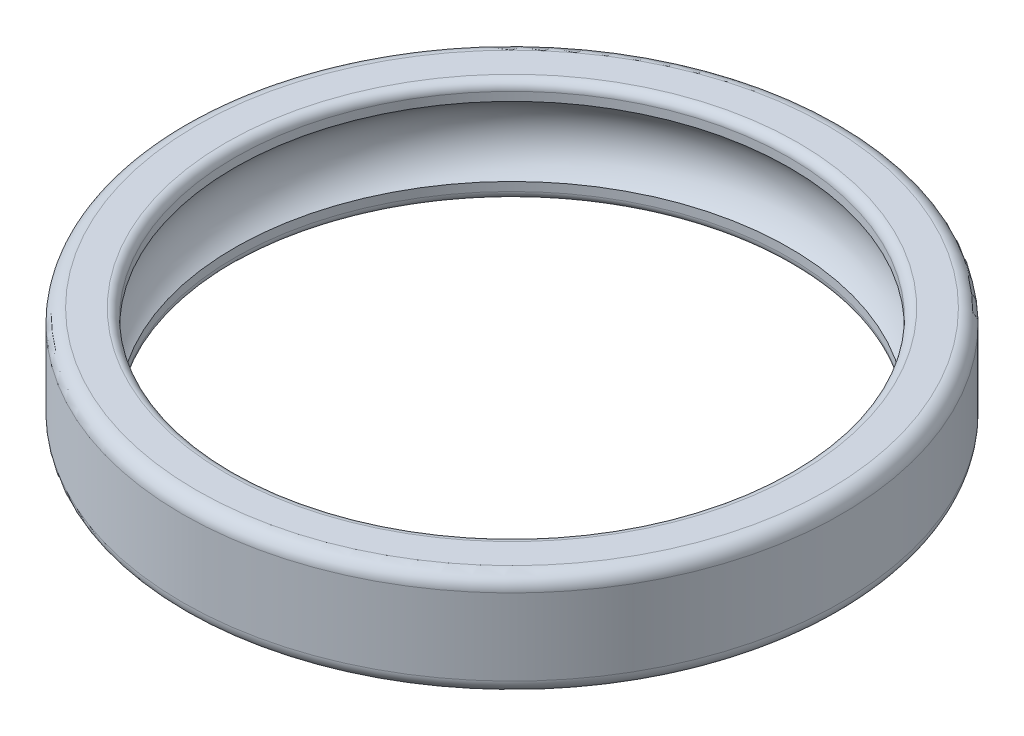
ISO-10303-21;
HEADER;
FILE_DESCRIPTION(('STEP AP214'),'2;1');
FILE_NAME('part.step','',(''),(''),'','','');
FILE_SCHEMA(('AUTOMOTIVE_DESIGN { 1 0 10303 214 1 1 1 1 }'));
ENDSEC;
DATA;
#1=APPLICATION_CONTEXT('core data for automotive mechanical design processes');
#2=APPLICATION_PROTOCOL_DEFINITION('international standard','automotive_design',2000,#1);
#3=PRODUCT_CONTEXT('',#1,'mechanical');
#4=PRODUCT('Part','Part','',(#3));
#5=PRODUCT_RELATED_PRODUCT_CATEGORY('part','',(#4));
#6=PRODUCT_DEFINITION_FORMATION('','',#4);
#7=PRODUCT_DEFINITION_CONTEXT('part definition',#1,'design');
#8=PRODUCT_DEFINITION('design','',#6,#7);
#9=PRODUCT_DEFINITION_SHAPE('','',#8);
#10=(LENGTH_UNIT() NAMED_UNIT(*) SI_UNIT(.MILLI.,.METRE.));
#11=(NAMED_UNIT(*) PLANE_ANGLE_UNIT() SI_UNIT($,.RADIAN.));
#12=(NAMED_UNIT(*) SI_UNIT($,.STERADIAN.) SOLID_ANGLE_UNIT());
#13=UNCERTAINTY_MEASURE_WITH_UNIT(LENGTH_MEASURE(1.E-05),#10,'distance_accuracy_value','');
#14=(GEOMETRIC_REPRESENTATION_CONTEXT(3) GLOBAL_UNCERTAINTY_ASSIGNED_CONTEXT((#13)) GLOBAL_UNIT_ASSIGNED_CONTEXT((#10,
#11,#12)) REPRESENTATION_CONTEXT('',''));
#15=CARTESIAN_POINT('',(0.,0.,0.));
#16=DIRECTION('',(0.,0.,1.));
#17=DIRECTION('',(1.,0.,0.));
#18=AXIS2_PLACEMENT_3D('',#15,#16,#17);
#19=CARTESIAN_POINT('',(0.,6.,0.));
#20=DIRECTION('',(0.,-1.,0.));
#21=DIRECTION('',(0.,0.,-1.));
#22=AXIS2_PLACEMENT_3D('',#19,#20,#21);
#23=CYLINDRICAL_SURFACE('',#22,16.);
#24=CARTESIAN_POINT('',(0.,5.5,0.));
#25=DIRECTION('',(0.,1.,0.));
#26=DIRECTION('',(0.,0.,1.));
#27=AXIS2_PLACEMENT_3D('',#24,#25,#26);
#28=CIRCLE('',#27,16.);
#29=CARTESIAN_POINT('',(0.,5.5,16.));
#30=VERTEX_POINT('',#29);
#31=EDGE_CURVE('E59',#30,#30,#28,.T.);
#32=ORIENTED_EDGE('',*,*,#31,.T.);
#33=EDGE_LOOP('',(#32));
#34=FACE_BOUND('',#33,.T.);
#35=CARTESIAN_POINT('',(0.,5.,0.));
#36=DIRECTION('',(0.,-1.,0.));
#37=DIRECTION('',(0.,0.,-1.));
#38=AXIS2_PLACEMENT_3D('',#35,#36,#37);
#39=CIRCLE('',#38,16.);
#40=CARTESIAN_POINT('',(0.,5.,-16.));
#41=VERTEX_POINT('',#40);
#42=EDGE_CURVE('E84',#41,#41,#39,.T.);
#43=ORIENTED_EDGE('',*,*,#42,.T.);
#44=EDGE_LOOP('',(#43));
#45=FACE_BOUND('',#44,.T.);
#46=ADVANCED_FACE('F52',(#34,#45),#23,.F.);
#47=CARTESIAN_POINT('',(0.,0.5,0.));
#48=DIRECTION('',(0.,1.,0.));
#49=DIRECTION('',(0.,0.,1.));
#50=AXIS2_PLACEMENT_3D('',#47,#48,#49);
#51=CIRCLE('',#50,16.);
#52=CARTESIAN_POINT('',(0.,0.5,16.));
#53=VERTEX_POINT('',#52);
#54=EDGE_CURVE('E63',#53,#53,#51,.F.);
#55=ORIENTED_EDGE('',*,*,#54,.T.);
#56=EDGE_LOOP('',(#55));
#57=FACE_BOUND('',#56,.T.);
#58=CARTESIAN_POINT('',(0.,0.999999999999999,0.));
#59=DIRECTION('',(0.,1.,0.));
#60=DIRECTION('',(0.,0.,1.));
#61=AXIS2_PLACEMENT_3D('',#58,#59,#60);
#62=CIRCLE('',#61,16.);
#63=CARTESIAN_POINT('',(0.,0.999999999999999,16.));
#64=VERTEX_POINT('',#63);
#65=EDGE_CURVE('E87',#64,#64,#62,.T.);
#66=ORIENTED_EDGE('',*,*,#65,.T.);
#67=EDGE_LOOP('',(#66));
#68=FACE_BOUND('',#67,.T.);
#69=ADVANCED_FACE('F91',(#57,#68),#23,.F.);
#70=CARTESIAN_POINT('',(0.,6.,0.));
#71=DIRECTION('',(0.,1.,0.));
#72=DIRECTION('',(0.,0.,1.));
#73=AXIS2_PLACEMENT_3D('',#70,#71,#72);
#74=PLANE('',#73);
#75=CARTESIAN_POINT('',(0.,6.,0.));
#76=DIRECTION('',(0.,1.,0.));
#77=DIRECTION('',(0.,0.,1.));
#78=AXIS2_PLACEMENT_3D('',#75,#76,#77);
#79=CIRCLE('',#78,16.5);
#80=CARTESIAN_POINT('',(0.,6.,16.5));
#81=VERTEX_POINT('',#80);
#82=EDGE_CURVE('E38',#81,#81,#79,.F.);
#83=ORIENTED_EDGE('',*,*,#82,.T.);
#84=EDGE_LOOP('',(#83));
#85=FACE_BOUND('',#84,.T.);
#86=CARTESIAN_POINT('',(0.,6.,0.));
#87=DIRECTION('',(0.,1.,0.));
#88=DIRECTION('',(0.,0.,1.));
#89=AXIS2_PLACEMENT_3D('',#86,#87,#88);
#90=CIRCLE('',#89,18.2);
#91=CARTESIAN_POINT('',(0.,6.,18.2));
#92=VERTEX_POINT('',#91);
#93=EDGE_CURVE('E81',#92,#92,#90,.T.);
#94=ORIENTED_EDGE('',*,*,#93,.T.);
#95=EDGE_LOOP('',(#94));
#96=FACE_BOUND('',#95,.T.);
#97=ADVANCED_FACE('F115',(#85,#96),#74,.T.);
#98=CARTESIAN_POINT('',(0.,0.,0.));
#99=DIRECTION('',(0.,1.,0.));
#100=DIRECTION('',(0.,0.,1.));
#101=AXIS2_PLACEMENT_3D('',#98,#99,#100);
#102=PLANE('',#101);
#103=CARTESIAN_POINT('',(0.,0.,0.));
#104=DIRECTION('',(0.,1.,0.));
#105=DIRECTION('',(0.,0.,1.));
#106=AXIS2_PLACEMENT_3D('',#103,#104,#105);
#107=CIRCLE('',#106,16.5);
#108=CARTESIAN_POINT('',(0.,0.,16.5));
#109=VERTEX_POINT('',#108);
#110=EDGE_CURVE('E67',#109,#109,#107,.T.);
#111=ORIENTED_EDGE('',*,*,#110,.T.);
#112=EDGE_LOOP('',(#111));
#113=FACE_BOUND('',#112,.T.);
#114=CARTESIAN_POINT('',(0.,0.,0.));
#115=DIRECTION('',(0.,1.,0.));
#116=DIRECTION('',(0.,0.,1.));
#117=AXIS2_PLACEMENT_3D('',#114,#115,#116);
#118=CIRCLE('',#117,18.2);
#119=CARTESIAN_POINT('',(0.,0.,18.2));
#120=VERTEX_POINT('',#119);
#121=EDGE_CURVE('E72',#120,#120,#118,.F.);
#122=ORIENTED_EDGE('',*,*,#121,.T.);
#123=EDGE_LOOP('',(#122));
#124=FACE_BOUND('',#123,.T.);
#125=ADVANCED_FACE('F106',(#113,#124),#102,.F.);
#126=CARTESIAN_POINT('',(0.,6.,0.));
#127=DIRECTION('',(0.,-1.,0.));
#128=DIRECTION('',(0.,0.,-1.));
#129=AXIS2_PLACEMENT_3D('',#126,#127,#128);
#130=CYLINDRICAL_SURFACE('',#129,19.);
#131=CARTESIAN_POINT('',(0.,5.2,0.));
#132=DIRECTION('',(0.,1.,0.));
#133=DIRECTION('',(0.,0.,1.));
#134=AXIS2_PLACEMENT_3D('',#131,#132,#133);
#135=CIRCLE('',#134,19.);
#136=CARTESIAN_POINT('',(0.,5.2,19.));
#137=VERTEX_POINT('',#136);
#138=EDGE_CURVE('E75',#137,#137,#135,.F.);
#139=ORIENTED_EDGE('',*,*,#138,.T.);
#140=EDGE_LOOP('',(#139));
#141=FACE_BOUND('',#140,.T.);
#142=CARTESIAN_POINT('',(0.,0.8,0.));
#143=DIRECTION('',(0.,1.,0.));
#144=DIRECTION('',(0.,0.,1.));
#145=AXIS2_PLACEMENT_3D('',#142,#143,#144);
#146=CIRCLE('',#145,19.);
#147=CARTESIAN_POINT('',(0.,0.8,19.));
#148=VERTEX_POINT('',#147);
#149=EDGE_CURVE('E78',#148,#148,#146,.T.);
#150=ORIENTED_EDGE('',*,*,#149,.T.);
#151=EDGE_LOOP('',(#150));
#152=FACE_BOUND('',#151,.T.);
#153=ADVANCED_FACE('F96',(#141,#152),#130,.T.);
#154=CARTESIAN_POINT('',(0.,3.,0.));
#155=DIRECTION('',(0.,1.,0.));
#156=DIRECTION('',(0.,0.,1.));
#157=AXIS2_PLACEMENT_3D('',#154,#155,#156);
#158=TOROIDAL_SURFACE('',#157,14.5,2.5);
#159=ORIENTED_EDGE('',*,*,#42,.F.);
#160=EDGE_LOOP('',(#159));
#161=FACE_BOUND('',#160,.T.);
#162=ORIENTED_EDGE('',*,*,#65,.F.);
#163=EDGE_LOOP('',(#162));
#164=FACE_BOUND('',#163,.T.);
#165=ADVANCED_FACE('F93',(#161,#164),#158,.F.);
#166=CARTESIAN_POINT('',(0.,5.2,0.));
#167=DIRECTION('',(0.,1.,0.));
#168=DIRECTION('',(0.,0.,1.));
#169=AXIS2_PLACEMENT_3D('',#166,#167,#168);
#170=TOROIDAL_SURFACE('',#169,18.2,0.8);
#171=ORIENTED_EDGE('',*,*,#138,.F.);
#172=EDGE_LOOP('',(#171));
#173=FACE_BOUND('',#172,.T.);
#174=ORIENTED_EDGE('',*,*,#93,.F.);
#175=EDGE_LOOP('',(#174));
#176=FACE_BOUND('',#175,.T.);
#177=ADVANCED_FACE('F95',(#173,#176),#170,.T.);
#178=CARTESIAN_POINT('',(0.,0.8,0.));
#179=DIRECTION('',(0.,1.,0.));
#180=DIRECTION('',(0.,0.,1.));
#181=AXIS2_PLACEMENT_3D('',#178,#179,#180);
#182=TOROIDAL_SURFACE('',#181,18.2,0.8);
#183=ORIENTED_EDGE('',*,*,#121,.F.);
#184=EDGE_LOOP('',(#183));
#185=FACE_BOUND('',#184,.T.);
#186=ORIENTED_EDGE('',*,*,#149,.F.);
#187=EDGE_LOOP('',(#186));
#188=FACE_BOUND('',#187,.T.);
#189=ADVANCED_FACE('F103',(#185,#188),#182,.T.);
#190=CARTESIAN_POINT('',(0.,0.5,0.));
#191=DIRECTION('',(0.,1.,0.));
#192=DIRECTION('',(0.,0.,1.));
#193=AXIS2_PLACEMENT_3D('',#190,#191,#192);
#194=TOROIDAL_SURFACE('',#193,16.5,0.5);
#195=ORIENTED_EDGE('',*,*,#54,.F.);
#196=EDGE_LOOP('',(#195));
#197=FACE_BOUND('',#196,.T.);
#198=ORIENTED_EDGE('',*,*,#110,.F.);
#199=EDGE_LOOP('',(#198));
#200=FACE_BOUND('',#199,.T.);
#201=ADVANCED_FACE('F125',(#197,#200),#194,.T.);
#202=CARTESIAN_POINT('',(0.,5.5,0.));
#203=DIRECTION('',(0.,1.,0.));
#204=DIRECTION('',(0.,0.,1.));
#205=AXIS2_PLACEMENT_3D('',#202,#203,#204);
#206=TOROIDAL_SURFACE('',#205,16.5,0.5);
#207=ORIENTED_EDGE('',*,*,#82,.F.);
#208=EDGE_LOOP('',(#207));
#209=FACE_BOUND('',#208,.T.);
#210=ORIENTED_EDGE('',*,*,#31,.F.);
#211=EDGE_LOOP('',(#210));
#212=FACE_BOUND('',#211,.T.);
#213=ADVANCED_FACE('F54',(#209,#212),#206,.T.);
#214=CLOSED_SHELL('',(#46,#69,#97,#125,#153,#165,#177,#189,#201,#213));
#215=MANIFOLD_SOLID_BREP('B6',#214);
#216=ADVANCED_BREP_SHAPE_REPRESENTATION('',(#18,#215),#14);
#217=SHAPE_DEFINITION_REPRESENTATION(#9,#216);
ENDSEC;
END-ISO-10303-21;
